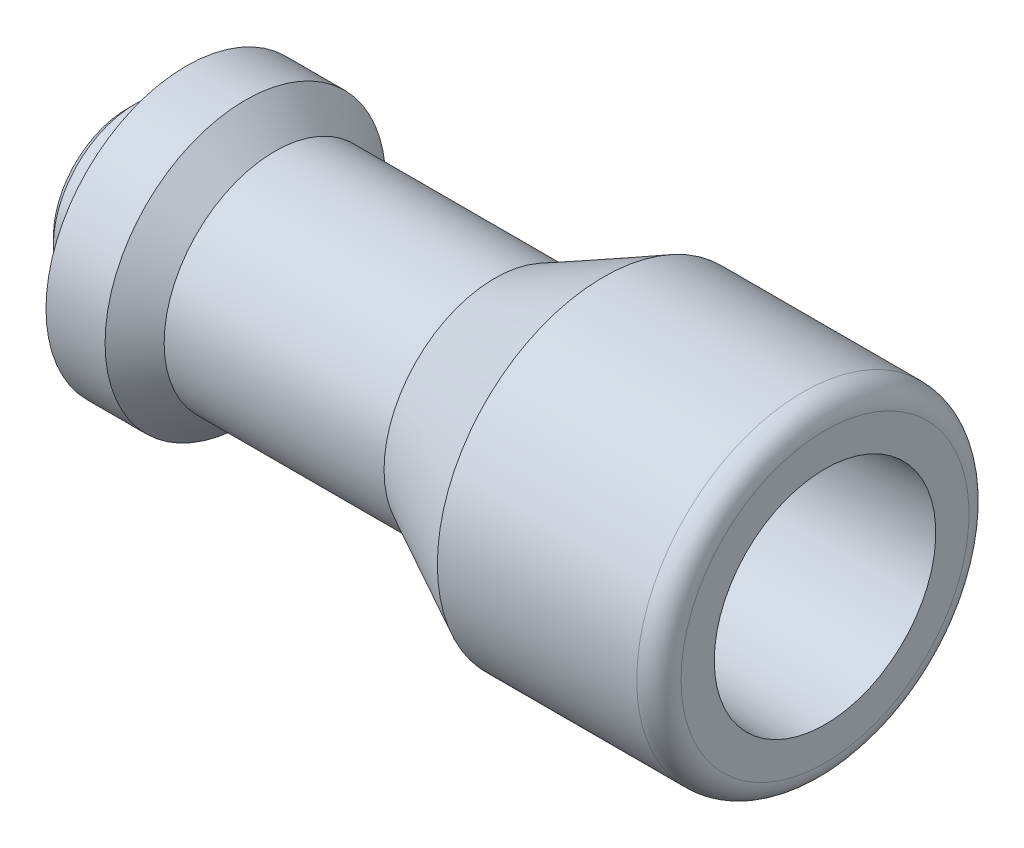
ISO-10303-21;
HEADER;
FILE_DESCRIPTION(('STEP AP214'),'2;1');
FILE_NAME('part.step','',(''),(''),'','','');
FILE_SCHEMA(('AUTOMOTIVE_DESIGN { 1 0 10303 214 1 1 1 1 }'));
ENDSEC;
DATA;
#1=APPLICATION_CONTEXT('core data for automotive mechanical design processes');
#2=APPLICATION_PROTOCOL_DEFINITION('international standard','automotive_design',2000,#1);
#3=PRODUCT_CONTEXT('',#1,'mechanical');
#4=PRODUCT('Part','Part','',(#3));
#5=PRODUCT_RELATED_PRODUCT_CATEGORY('part','',(#4));
#6=PRODUCT_DEFINITION_FORMATION('','',#4);
#7=PRODUCT_DEFINITION_CONTEXT('part definition',#1,'design');
#8=PRODUCT_DEFINITION('design','',#6,#7);
#9=PRODUCT_DEFINITION_SHAPE('','',#8);
#10=(LENGTH_UNIT() NAMED_UNIT(*) SI_UNIT(.MILLI.,.METRE.));
#11=(NAMED_UNIT(*) PLANE_ANGLE_UNIT() SI_UNIT($,.RADIAN.));
#12=(NAMED_UNIT(*) SI_UNIT($,.STERADIAN.) SOLID_ANGLE_UNIT());
#13=UNCERTAINTY_MEASURE_WITH_UNIT(LENGTH_MEASURE(1.E-05),#10,'distance_accuracy_value','');
#14=(GEOMETRIC_REPRESENTATION_CONTEXT(3) GLOBAL_UNCERTAINTY_ASSIGNED_CONTEXT((#13)) GLOBAL_UNIT_ASSIGNED_CONTEXT((#10,
#11,#12)) REPRESENTATION_CONTEXT('',''));
#15=CARTESIAN_POINT('',(0.,0.,0.));
#16=DIRECTION('',(0.,0.,1.));
#17=DIRECTION('',(1.,0.,0.));
#18=AXIS2_PLACEMENT_3D('',#15,#16,#17);
#19=CARTESIAN_POINT('',(0.,10.,0.));
#20=DIRECTION('',(1.,0.,0.));
#21=DIRECTION('',(0.,0.,-1.));
#22=AXIS2_PLACEMENT_3D('',#19,#20,#21);
#23=PLANE('',#22);
#24=CARTESIAN_POINT('',(0.,0.,0.));
#25=DIRECTION('',(-1.,0.,0.));
#26=DIRECTION('',(0.,0.,1.));
#27=AXIS2_PLACEMENT_3D('',#24,#25,#26);
#28=CIRCLE('',#27,10.);
#29=CARTESIAN_POINT('',(0.,0.,10.));
#30=VERTEX_POINT('',#29);
#31=EDGE_CURVE('E114',#30,#30,#28,.T.);
#32=ORIENTED_EDGE('',*,*,#31,.T.);
#33=EDGE_LOOP('',(#32));
#34=FACE_BOUND('',#33,.T.);
#35=ADVANCED_FACE('F36',(#34),#23,.F.);
#36=CARTESIAN_POINT('',(41.5555136271329,0.,0.));
#37=DIRECTION('',(1.,0.,0.));
#38=DIRECTION('',(0.,0.,-1.));
#39=AXIS2_PLACEMENT_3D('',#36,#37,#38);
#40=CONICAL_SURFACE('',#39,0.,1.04719755119659);
#41=CARTESIAN_POINT('',(44.5,0.,0.));
#42=DIRECTION('',(-1.,0.,0.));
#43=DIRECTION('',(0.,0.,1.));
#44=AXIS2_PLACEMENT_3D('',#41,#42,#43);
#45=CIRCLE('',#44,5.1);
#46=CARTESIAN_POINT('',(44.5,0.,5.1));
#47=VERTEX_POINT('',#46);
#48=EDGE_CURVE('E11',#47,#47,#45,.T.);
#49=ORIENTED_EDGE('',*,*,#48,.F.);
#50=EDGE_LOOP('',(#49));
#51=FACE_BOUND('',#50,.T.);
#52=CARTESIAN_POINT('',(41.5555136271329,0.,0.));
#53=VERTEX_POINT('',#52);
#54=VERTEX_LOOP('',#53);
#55=FACE_BOUND('',#54,.T.);
#56=ADVANCED_FACE('F45',(#51,#55),#40,.F.);
#57=CARTESIAN_POINT('',(0.,0.,0.));
#58=DIRECTION('',(-1.,0.,0.));
#59=DIRECTION('',(0.,0.,1.));
#60=AXIS2_PLACEMENT_3D('',#57,#58,#59);
#61=CYLINDRICAL_SURFACE('',#60,5.1);
#62=CARTESIAN_POINT('',(66.5,0.,0.));
#63=DIRECTION('',(-1.,0.,0.));
#64=DIRECTION('',(0.,0.,1.));
#65=AXIS2_PLACEMENT_3D('',#62,#63,#64);
#66=CIRCLE('',#65,5.1);
#67=CARTESIAN_POINT('',(66.5,0.,5.1));
#68=VERTEX_POINT('',#67);
#69=EDGE_CURVE('E42',#68,#68,#66,.T.);
#70=ORIENTED_EDGE('',*,*,#69,.F.);
#71=EDGE_LOOP('',(#70));
#72=FACE_BOUND('',#71,.T.);
#73=ORIENTED_EDGE('',*,*,#48,.T.);
#74=EDGE_LOOP('',(#73));
#75=FACE_BOUND('',#74,.T.);
#76=ADVANCED_FACE('F47',(#72,#75),#61,.F.);
#77=CARTESIAN_POINT('',(66.5,13.2496674343854,0.));
#78=DIRECTION('',(-1.,0.,0.));
#79=DIRECTION('',(0.,0.,1.));
#80=AXIS2_PLACEMENT_3D('',#77,#78,#79);
#81=PLANE('',#80);
#82=CARTESIAN_POINT('',(66.5,0.,0.));
#83=DIRECTION('',(-1.,0.,0.));
#84=DIRECTION('',(0.,0.,1.));
#85=AXIS2_PLACEMENT_3D('',#82,#83,#84);
#86=CIRCLE('',#85,13.2496674343854);
#87=CARTESIAN_POINT('',(66.5,0.,13.2496674343854));
#88=VERTEX_POINT('',#87);
#89=EDGE_CURVE('E151',#88,#88,#86,.T.);
#90=ORIENTED_EDGE('',*,*,#89,.F.);
#91=EDGE_LOOP('',(#90));
#92=FACE_BOUND('',#91,.T.);
#93=ORIENTED_EDGE('',*,*,#69,.T.);
#94=EDGE_LOOP('',(#93));
#95=FACE_BOUND('',#94,.T.);
#96=ADVANCED_FACE('F53',(#92,#95),#81,.F.);
#97=CARTESIAN_POINT('',(67.3,0.,0.));
#98=DIRECTION('',(-1.,0.,0.));
#99=DIRECTION('',(0.,0.,1.));
#100=AXIS2_PLACEMENT_3D('',#97,#98,#99);
#101=TOROIDAL_SURFACE('',#100,13.2496674343854,0.799999999999998);
#102=CARTESIAN_POINT('',(67.272080402638,0.,0.));
#103=DIRECTION('',(-1.,0.,0.));
#104=DIRECTION('',(0.,0.,1.));
#105=AXIS2_PLACEMENT_3D('',#102,#103,#104);
#106=CIRCLE('',#105,14.0491800960007);
#107=CARTESIAN_POINT('',(67.272080402638,0.,14.0491800960007));
#108=VERTEX_POINT('',#107);
#109=EDGE_CURVE('E148',#108,#108,#106,.T.);
#110=ORIENTED_EDGE('',*,*,#109,.F.);
#111=EDGE_LOOP('',(#110));
#112=FACE_BOUND('',#111,.T.);
#113=ORIENTED_EDGE('',*,*,#89,.T.);
#114=EDGE_LOOP('',(#113));
#115=FACE_BOUND('',#114,.T.);
#116=ADVANCED_FACE('F61',(#112,#115),#101,.F.);
#117=CARTESIAN_POINT('',(67.272080402638,0.,0.));
#118=DIRECTION('',(1.,0.,0.));
#119=DIRECTION('',(0.,0.,-1.));
#120=AXIS2_PLACEMENT_3D('',#117,#118,#119);
#121=CONICAL_SURFACE('',#120,14.0491800960007,0.0349065850398874);
#122=CARTESIAN_POINT('',(94.5,0.,0.));
#123=DIRECTION('',(-1.,0.,0.));
#124=DIRECTION('',(0.,0.,1.));
#125=AXIS2_PLACEMENT_3D('',#122,#123,#124);
#126=CIRCLE('',#125,15.);
#127=CARTESIAN_POINT('',(94.5,0.,15.));
#128=VERTEX_POINT('',#127);
#129=EDGE_CURVE('E145',#128,#128,#126,.T.);
#130=ORIENTED_EDGE('',*,*,#129,.F.);
#131=EDGE_LOOP('',(#130));
#132=FACE_BOUND('',#131,.T.);
#133=ORIENTED_EDGE('',*,*,#109,.T.);
#134=EDGE_LOOP('',(#133));
#135=FACE_BOUND('',#134,.T.);
#136=ADVANCED_FACE('F65',(#132,#135),#121,.F.);
#137=CARTESIAN_POINT('',(94.5,15.,0.));
#138=DIRECTION('',(-1.,0.,0.));
#139=DIRECTION('',(0.,0.,1.));
#140=AXIS2_PLACEMENT_3D('',#137,#138,#139);
#141=PLANE('',#140);
#142=CARTESIAN_POINT('',(94.5,0.,0.));
#143=DIRECTION('',(-1.,0.,0.));
#144=DIRECTION('',(0.,0.,1.));
#145=AXIS2_PLACEMENT_3D('',#142,#143,#144);
#146=CIRCLE('',#145,19.5);
#147=CARTESIAN_POINT('',(94.5,0.,19.5));
#148=VERTEX_POINT('',#147);
#149=EDGE_CURVE('E142',#148,#148,#146,.T.);
#150=ORIENTED_EDGE('',*,*,#149,.F.);
#151=EDGE_LOOP('',(#150));
#152=FACE_BOUND('',#151,.T.);
#153=ORIENTED_EDGE('',*,*,#129,.T.);
#154=EDGE_LOOP('',(#153));
#155=FACE_BOUND('',#154,.T.);
#156=ADVANCED_FACE('F69',(#152,#155),#141,.F.);
#157=CARTESIAN_POINT('',(91.5,0.,0.));
#158=DIRECTION('',(-1.,0.,0.));
#159=DIRECTION('',(0.,0.,1.));
#160=AXIS2_PLACEMENT_3D('',#157,#158,#159);
#161=TOROIDAL_SURFACE('',#160,19.5,3.);
#162=CARTESIAN_POINT('',(91.5,0.,0.));
#163=DIRECTION('',(-1.,0.,0.));
#164=DIRECTION('',(0.,0.,1.));
#165=AXIS2_PLACEMENT_3D('',#162,#163,#164);
#166=CIRCLE('',#165,22.5);
#167=CARTESIAN_POINT('',(91.5,0.,22.5));
#168=VERTEX_POINT('',#167);
#169=EDGE_CURVE('E139',#168,#168,#166,.T.);
#170=ORIENTED_EDGE('',*,*,#169,.F.);
#171=EDGE_LOOP('',(#170));
#172=FACE_BOUND('',#171,.T.);
#173=ORIENTED_EDGE('',*,*,#149,.T.);
#174=EDGE_LOOP('',(#173));
#175=FACE_BOUND('',#174,.T.);
#176=ADVANCED_FACE('F73',(#172,#175),#161,.T.);
#177=CARTESIAN_POINT('',(0.,0.,0.));
#178=DIRECTION('',(-1.,0.,0.));
#179=DIRECTION('',(0.,0.,1.));
#180=AXIS2_PLACEMENT_3D('',#177,#178,#179);
#181=CYLINDRICAL_SURFACE('',#180,22.5);
#182=CARTESIAN_POINT('',(64.5,0.,0.));
#183=DIRECTION('',(-1.,0.,0.));
#184=DIRECTION('',(0.,0.,1.));
#185=AXIS2_PLACEMENT_3D('',#182,#183,#184);
#186=CIRCLE('',#185,22.5);
#187=CARTESIAN_POINT('',(64.5,0.,22.5));
#188=VERTEX_POINT('',#187);
#189=EDGE_CURVE('E136',#188,#188,#186,.T.);
#190=ORIENTED_EDGE('',*,*,#189,.F.);
#191=EDGE_LOOP('',(#190));
#192=FACE_BOUND('',#191,.T.);
#193=ORIENTED_EDGE('',*,*,#169,.T.);
#194=EDGE_LOOP('',(#193));
#195=FACE_BOUND('',#194,.T.);
#196=ADVANCED_FACE('F77',(#192,#195),#181,.T.);
#197=CARTESIAN_POINT('',(64.5,0.,0.));
#198=DIRECTION('',(1.,0.,0.));
#199=DIRECTION('',(0.,0.,-1.));
#200=AXIS2_PLACEMENT_3D('',#197,#198,#199);
#201=CONICAL_SURFACE('',#200,22.5,0.47123889803847);
#202=CARTESIAN_POINT('',(49.7804212087114,0.,0.));
#203=DIRECTION('',(-1.,0.,0.));
#204=DIRECTION('',(0.,0.,1.));
#205=AXIS2_PLACEMENT_3D('',#202,#203,#204);
#206=CIRCLE('',#205,15.);
#207=CARTESIAN_POINT('',(49.7804212087114,0.,15.));
#208=VERTEX_POINT('',#207);
#209=EDGE_CURVE('E133',#208,#208,#206,.T.);
#210=ORIENTED_EDGE('',*,*,#209,.F.);
#211=EDGE_LOOP('',(#210));
#212=FACE_BOUND('',#211,.T.);
#213=ORIENTED_EDGE('',*,*,#189,.T.);
#214=EDGE_LOOP('',(#213));
#215=FACE_BOUND('',#214,.T.);
#216=ADVANCED_FACE('F81',(#212,#215),#201,.T.);
#217=CARTESIAN_POINT('',(0.,0.,0.));
#218=DIRECTION('',(-1.,0.,0.));
#219=DIRECTION('',(0.,0.,1.));
#220=AXIS2_PLACEMENT_3D('',#217,#218,#219);
#221=CYLINDRICAL_SURFACE('',#220,15.);
#222=CARTESIAN_POINT('',(20.,0.,0.));
#223=DIRECTION('',(-1.,0.,0.));
#224=DIRECTION('',(0.,0.,1.));
#225=AXIS2_PLACEMENT_3D('',#222,#223,#224);
#226=CIRCLE('',#225,15.);
#227=CARTESIAN_POINT('',(20.,0.,15.));
#228=VERTEX_POINT('',#227);
#229=EDGE_CURVE('E130',#228,#228,#226,.T.);
#230=ORIENTED_EDGE('',*,*,#229,.F.);
#231=EDGE_LOOP('',(#230));
#232=FACE_BOUND('',#231,.T.);
#233=ORIENTED_EDGE('',*,*,#209,.T.);
#234=EDGE_LOOP('',(#233));
#235=FACE_BOUND('',#234,.T.);
#236=ADVANCED_FACE('F85',(#232,#235),#221,.T.);
#237=CARTESIAN_POINT('',(20.,0.,0.));
#238=DIRECTION('',(-1.,0.,0.));
#239=DIRECTION('',(0.,0.,1.));
#240=AXIS2_PLACEMENT_3D('',#237,#238,#239);
#241=CONICAL_SURFACE('',#240,15.,0.78539816339745);
#242=CARTESIAN_POINT('',(16.,0.,0.));
#243=DIRECTION('',(-1.,0.,0.));
#244=DIRECTION('',(0.,0.,1.));
#245=AXIS2_PLACEMENT_3D('',#242,#243,#244);
#246=CIRCLE('',#245,19.);
#247=CARTESIAN_POINT('',(16.,0.,19.));
#248=VERTEX_POINT('',#247);
#249=EDGE_CURVE('E127',#248,#248,#246,.T.);
#250=ORIENTED_EDGE('',*,*,#249,.F.);
#251=EDGE_LOOP('',(#250));
#252=FACE_BOUND('',#251,.T.);
#253=ORIENTED_EDGE('',*,*,#229,.T.);
#254=EDGE_LOOP('',(#253));
#255=FACE_BOUND('',#254,.T.);
#256=ADVANCED_FACE('F89',(#252,#255),#241,.T.);
#257=CARTESIAN_POINT('',(0.,0.,0.));
#258=DIRECTION('',(-1.,0.,0.));
#259=DIRECTION('',(0.,0.,1.));
#260=AXIS2_PLACEMENT_3D('',#257,#258,#259);
#261=CYLINDRICAL_SURFACE('',#260,19.);
#262=CARTESIAN_POINT('',(7.99999999999999,0.,0.));
#263=DIRECTION('',(-1.,0.,0.));
#264=DIRECTION('',(0.,0.,1.));
#265=AXIS2_PLACEMENT_3D('',#262,#263,#264);
#266=CIRCLE('',#265,19.);
#267=CARTESIAN_POINT('',(7.99999999999999,0.,19.));
#268=VERTEX_POINT('',#267);
#269=EDGE_CURVE('E121',#268,#268,#266,.T.);
#270=ORIENTED_EDGE('',*,*,#269,.F.);
#271=EDGE_LOOP('',(#270));
#272=FACE_BOUND('',#271,.T.);
#273=ORIENTED_EDGE('',*,*,#249,.T.);
#274=EDGE_LOOP('',(#273));
#275=FACE_BOUND('',#274,.T.);
#276=ADVANCED_FACE('F93',(#272,#275),#261,.T.);
#277=CARTESIAN_POINT('',(7.99999999999999,19.,0.));
#278=DIRECTION('',(1.,0.,0.));
#279=DIRECTION('',(0.,0.,-1.));
#280=AXIS2_PLACEMENT_3D('',#277,#278,#279);
#281=PLANE('',#280);
#282=CARTESIAN_POINT('',(7.99999999999999,0.,0.));
#283=DIRECTION('',(-1.,0.,0.));
#284=DIRECTION('',(0.,0.,1.));
#285=AXIS2_PLACEMENT_3D('',#282,#283,#284);
#286=CIRCLE('',#285,11.);
#287=CARTESIAN_POINT('',(7.99999999999999,0.,11.));
#288=VERTEX_POINT('',#287);
#289=EDGE_CURVE('E118',#288,#288,#286,.T.);
#290=ORIENTED_EDGE('',*,*,#289,.F.);
#291=EDGE_LOOP('',(#290));
#292=FACE_BOUND('',#291,.T.);
#293=ORIENTED_EDGE('',*,*,#269,.T.);
#294=EDGE_LOOP('',(#293));
#295=FACE_BOUND('',#294,.T.);
#296=ADVANCED_FACE('F97',(#292,#295),#281,.F.);
#297=CARTESIAN_POINT('',(0.,0.,0.));
#298=DIRECTION('',(-1.,0.,0.));
#299=DIRECTION('',(0.,0.,1.));
#300=AXIS2_PLACEMENT_3D('',#297,#298,#299);
#301=CYLINDRICAL_SURFACE('',#300,11.);
#302=CARTESIAN_POINT('',(1.,0.,0.));
#303=DIRECTION('',(-1.,0.,0.));
#304=DIRECTION('',(0.,0.,1.));
#305=AXIS2_PLACEMENT_3D('',#302,#303,#304);
#306=CIRCLE('',#305,11.);
#307=CARTESIAN_POINT('',(1.,0.,11.));
#308=VERTEX_POINT('',#307);
#309=EDGE_CURVE('E117',#308,#308,#306,.T.);
#310=ORIENTED_EDGE('',*,*,#309,.F.);
#311=EDGE_LOOP('',(#310));
#312=FACE_BOUND('',#311,.T.);
#313=ORIENTED_EDGE('',*,*,#289,.T.);
#314=EDGE_LOOP('',(#313));
#315=FACE_BOUND('',#314,.T.);
#316=ADVANCED_FACE('F101',(#312,#315),#301,.T.);
#317=CARTESIAN_POINT('',(1.,0.,0.));
#318=DIRECTION('',(1.,0.,0.));
#319=DIRECTION('',(0.,0.,-1.));
#320=AXIS2_PLACEMENT_3D('',#317,#318,#319);
#321=CONICAL_SURFACE('',#320,11.,0.785398163397444);
#322=ORIENTED_EDGE('',*,*,#31,.F.);
#323=EDGE_LOOP('',(#322));
#324=FACE_BOUND('',#323,.T.);
#325=ORIENTED_EDGE('',*,*,#309,.T.);
#326=EDGE_LOOP('',(#325));
#327=FACE_BOUND('',#326,.T.);
#328=ADVANCED_FACE('F105',(#324,#327),#321,.T.);
#329=CLOSED_SHELL('',(#35,#56,#76,#96,#116,#136,#156,#176,#196,#216,#236,#256,#276,#296,#316,#328));
#330=MANIFOLD_SOLID_BREP('B2',#329);
#331=ADVANCED_BREP_SHAPE_REPRESENTATION('',(#18,#330),#14);
#332=SHAPE_DEFINITION_REPRESENTATION(#9,#331);
ENDSEC;
END-ISO-10303-21;
